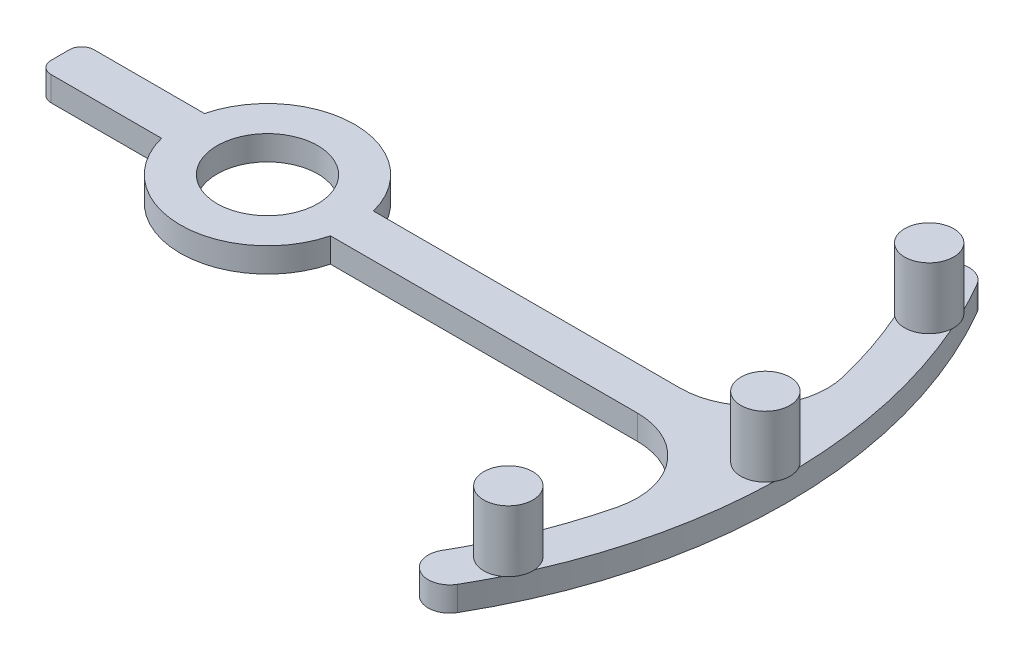
ISO-10303-21;
HEADER;
FILE_DESCRIPTION(('STEP AP214'),'2;1');
FILE_NAME('part.step','',(''),(''),'','','');
FILE_SCHEMA(('AUTOMOTIVE_DESIGN { 1 0 10303 214 1 1 1 1 }'));
ENDSEC;
DATA;
#1=APPLICATION_CONTEXT('core data for automotive mechanical design processes');
#2=APPLICATION_PROTOCOL_DEFINITION('international standard','automotive_design',2000,#1);
#3=PRODUCT_CONTEXT('',#1,'mechanical');
#4=PRODUCT('Part','Part','',(#3));
#5=PRODUCT_RELATED_PRODUCT_CATEGORY('part','',(#4));
#6=PRODUCT_DEFINITION_FORMATION('','',#4);
#7=PRODUCT_DEFINITION_CONTEXT('part definition',#1,'design');
#8=PRODUCT_DEFINITION('design','',#6,#7);
#9=PRODUCT_DEFINITION_SHAPE('','',#8);
#10=(LENGTH_UNIT() NAMED_UNIT(*) SI_UNIT(.MILLI.,.METRE.));
#11=(NAMED_UNIT(*) PLANE_ANGLE_UNIT() SI_UNIT($,.RADIAN.));
#12=(NAMED_UNIT(*) SI_UNIT($,.STERADIAN.) SOLID_ANGLE_UNIT());
#13=UNCERTAINTY_MEASURE_WITH_UNIT(LENGTH_MEASURE(1.E-05),#10,'distance_accuracy_value','');
#14=(GEOMETRIC_REPRESENTATION_CONTEXT(3) GLOBAL_UNCERTAINTY_ASSIGNED_CONTEXT((#13)) GLOBAL_UNIT_ASSIGNED_CONTEXT((#10,
#11,#12)) REPRESENTATION_CONTEXT('',''));
#15=CARTESIAN_POINT('',(0.,0.,0.));
#16=DIRECTION('',(0.,0.,1.));
#17=DIRECTION('',(1.,0.,0.));
#18=AXIS2_PLACEMENT_3D('',#15,#16,#17);
#19=CARTESIAN_POINT('',(0.,2.,0.));
#20=DIRECTION('',(0.,1.,0.));
#21=DIRECTION('',(0.,0.,1.));
#22=AXIS2_PLACEMENT_3D('',#19,#20,#21);
#23=PLANE('',#22);
#24=CARTESIAN_POINT('',(0.,2.,0.));
#25=DIRECTION('',(0.,1.,0.));
#26=DIRECTION('',(0.,0.,1.));
#27=AXIS2_PLACEMENT_3D('',#24,#25,#26);
#28=CIRCLE('',#27,4.1);
#29=CARTESIAN_POINT('',(0.,2.,4.1));
#30=VERTEX_POINT('',#29);
#31=EDGE_CURVE('E219',#30,#30,#28,.T.);
#32=ORIENTED_EDGE('',*,*,#31,.F.);
#33=EDGE_LOOP('',(#32));
#34=FACE_BOUND('',#33,.T.);
#35=CARTESIAN_POINT('',(0.,2.,0.));
#36=DIRECTION('',(0.,1.,0.));
#37=DIRECTION('',(0.,0.,1.));
#38=AXIS2_PLACEMENT_3D('',#35,#36,#37);
#39=CIRCLE('',#38,42.3094244591551);
#40=CARTESIAN_POINT('',(38.7527909101627,2.,16.9796523738904));
#41=VERTEX_POINT('',#40);
#42=CARTESIAN_POINT('',(42.2978673424984,2.,0.988845964421582));
#43=VERTEX_POINT('',#42);
#44=EDGE_CURVE('E191',#41,#43,#39,.T.);
#45=ORIENTED_EDGE('',*,*,#44,.T.);
#46=CARTESIAN_POINT('',(40.5594244591551,2.,0.));
#47=DIRECTION('',(0.,1.,0.));
#48=DIRECTION('',(0.,0.,1.));
#49=AXIS2_PLACEMENT_3D('',#46,#47,#48);
#50=CIRCLE('',#49,2.);
#51=CARTESIAN_POINT('',(42.2978673424984,2.,-0.988845964421582));
#52=VERTEX_POINT('',#51);
#53=EDGE_CURVE('E189',#52,#43,#50,.T.);
#54=ORIENTED_EDGE('',*,*,#53,.F.);
#55=CARTESIAN_POINT('',(38.7527909101627,2.,-16.9796523738904));
#56=VERTEX_POINT('',#55);
#57=EDGE_CURVE('E178',#52,#56,#39,.T.);
#58=ORIENTED_EDGE('',*,*,#57,.T.);
#59=CARTESIAN_POINT('',(36.759322225057,2.,-17.1411534621314));
#60=DIRECTION('',(0.,1.,0.));
#61=DIRECTION('',(0.,0.,1.));
#62=AXIS2_PLACEMENT_3D('',#59,#60,#61);
#63=CIRCLE('',#62,2.);
#64=CARTESIAN_POINT('',(35.5630527786396,2.,-15.5383623305212));
#65=VERTEX_POINT('',#64);
#66=EDGE_CURVE('E42',#65,#56,#63,.T.);
#67=ORIENTED_EDGE('',*,*,#66,.F.);
#68=CARTESIAN_POINT('',(0.,2.,0.));
#69=DIRECTION('',(0.,-1.,0.));
#70=DIRECTION('',(0.,0.,1.));
#71=AXIS2_PLACEMENT_3D('',#68,#69,#70);
#72=CIRCLE('',#71,38.8094244591551);
#73=CARTESIAN_POINT('',(37.7111726544024,2.,-9.16727243408407));
#74=VERTEX_POINT('',#73);
#75=EDGE_CURVE('E243',#65,#74,#72,.T.);
#76=ORIENTED_EDGE('',*,*,#75,.T.);
#77=CARTESIAN_POINT('',(31.8809641656228,2.,-7.74999723943662));
#78=DIRECTION('',(0.,-1.,0.));
#79=DIRECTION('',(0.,0.,-1.));
#80=AXIS2_PLACEMENT_3D('',#77,#78,#79);
#81=CIRCLE('',#80,6.);
#82=CARTESIAN_POINT('',(31.8809641656226,2.,-1.74999723943662));
#83=VERTEX_POINT('',#82);
#84=EDGE_CURVE('E247',#74,#83,#81,.T.);
#85=ORIENTED_EDGE('',*,*,#84,.T.);
#86=DIRECTION('',(-1.,0.,0.));
#87=VECTOR('',#86,1.);
#88=CARTESIAN_POINT('',(6.88096422764181,2.,-1.74999723943758));
#89=LINE('',#88,#87);
#90=CARTESIAN_POINT('',(6.88096422764181,2.,-1.74999723943758));
#91=VERTEX_POINT('',#90);
#92=EDGE_CURVE('E250',#83,#91,#89,.T.);
#93=ORIENTED_EDGE('',*,*,#92,.T.);
#94=CARTESIAN_POINT('',(0.,2.,0.));
#95=DIRECTION('',(0.,1.,0.));
#96=DIRECTION('',(0.,0.,1.));
#97=AXIS2_PLACEMENT_3D('',#94,#95,#96);
#98=CIRCLE('',#97,7.1000112);
#99=CARTESIAN_POINT('',(-6.88132233720513,2.,-1.74858855412219));
#100=VERTEX_POINT('',#99);
#101=EDGE_CURVE('E252',#91,#100,#98,.T.);
#102=ORIENTED_EDGE('',*,*,#101,.T.);
#103=DIRECTION('',(-1.,0.,0.));
#104=VECTOR('',#103,1.);
#105=CARTESIAN_POINT('',(-6.88132233720513,2.,-1.74858855412218));
#106=LINE('',#105,#104);
#107=CARTESIAN_POINT('',(-15.8813223372051,2.,-1.74858855412218));
#108=VERTEX_POINT('',#107);
#109=EDGE_CURVE('E254',#100,#108,#106,.T.);
#110=ORIENTED_EDGE('',*,*,#109,.T.);
#111=CARTESIAN_POINT('',(-15.8813223372051,2.,-0.748588554122185));
#112=DIRECTION('',(0.,1.,0.));
#113=DIRECTION('',(0.,0.,1.));
#114=AXIS2_PLACEMENT_3D('',#111,#112,#113);
#115=CIRCLE('',#114,1.);
#116=CARTESIAN_POINT('',(-16.8813223372051,2.,-0.748588554122185));
#117=VERTEX_POINT('',#116);
#118=EDGE_CURVE('E256',#108,#117,#115,.T.);
#119=ORIENTED_EDGE('',*,*,#118,.T.);
#120=DIRECTION('',(0.,0.,1.));
#121=VECTOR('',#120,1.);
#122=CARTESIAN_POINT('',(-16.8813223372051,2.,-0.748588554122185));
#123=LINE('',#122,#121);
#124=CARTESIAN_POINT('',(-16.8813223372051,2.,0.748588554122185));
#125=VERTEX_POINT('',#124);
#126=EDGE_CURVE('E258',#117,#125,#123,.T.);
#127=ORIENTED_EDGE('',*,*,#126,.T.);
#128=CARTESIAN_POINT('',(-15.8813223372051,2.,0.748588554122185));
#129=DIRECTION('',(0.,1.,0.));
#130=DIRECTION('',(0.,0.,-1.));
#131=AXIS2_PLACEMENT_3D('',#128,#129,#130);
#132=CIRCLE('',#131,1.);
#133=CARTESIAN_POINT('',(-15.8813223372051,2.,1.74858855412219));
#134=VERTEX_POINT('',#133);
#135=EDGE_CURVE('E260',#125,#134,#132,.T.);
#136=ORIENTED_EDGE('',*,*,#135,.T.);
#137=DIRECTION('',(1.,0.,0.));
#138=VECTOR('',#137,1.);
#139=CARTESIAN_POINT('',(-6.88132233720513,2.,1.74858855412218));
#140=LINE('',#139,#138);
#141=CARTESIAN_POINT('',(-6.88132233720513,2.,1.74858855412218));
#142=VERTEX_POINT('',#141);
#143=EDGE_CURVE('E262',#134,#142,#140,.T.);
#144=ORIENTED_EDGE('',*,*,#143,.T.);
#145=CARTESIAN_POINT('',(0.,2.,0.));
#146=DIRECTION('',(0.,1.,0.));
#147=DIRECTION('',(0.,0.,1.));
#148=AXIS2_PLACEMENT_3D('',#145,#146,#147);
#149=CIRCLE('',#148,7.1000112);
#150=CARTESIAN_POINT('',(6.88096282348233,2.,1.75000276056338));
#151=VERTEX_POINT('',#150);
#152=EDGE_CURVE('E225',#142,#151,#149,.T.);
#153=ORIENTED_EDGE('',*,*,#152,.T.);
#154=DIRECTION('',(1.,0.,0.));
#155=VECTOR('',#154,1.);
#156=CARTESIAN_POINT('',(6.88096282348233,2.,1.75000276056338));
#157=LINE('',#156,#155);
#158=CARTESIAN_POINT('',(31.8809628234826,2.,1.75000276056338));
#159=VERTEX_POINT('',#158);
#160=EDGE_CURVE('E228',#151,#159,#157,.T.);
#161=ORIENTED_EDGE('',*,*,#160,.T.);
#162=CARTESIAN_POINT('',(31.8809628234823,2.,7.75000276056338));
#163=DIRECTION('',(0.,-1.,0.));
#164=DIRECTION('',(0.,0.,1.));
#165=AXIS2_PLACEMENT_3D('',#162,#163,#164);
#166=CIRCLE('',#165,6.);
#167=CARTESIAN_POINT('',(37.7111710668189,2.,9.16727896488293));
#168=VERTEX_POINT('',#167);
#169=EDGE_CURVE('E231',#159,#168,#166,.T.);
#170=ORIENTED_EDGE('',*,*,#169,.T.);
#171=CARTESIAN_POINT('',(0.,2.,0.));
#172=DIRECTION('',(0.,-1.,0.));
#173=DIRECTION('',(0.,0.,1.));
#174=AXIS2_PLACEMENT_3D('',#171,#172,#173);
#175=CIRCLE('',#174,38.8094244591551);
#176=CARTESIAN_POINT('',(35.5630527786396,2.,15.5383623305212));
#177=VERTEX_POINT('',#176);
#178=EDGE_CURVE('E234',#168,#177,#175,.T.);
#179=ORIENTED_EDGE('',*,*,#178,.T.);
#180=CARTESIAN_POINT('',(36.759322225057,2.,17.1411534621314));
#181=DIRECTION('',(0.,1.,0.));
#182=DIRECTION('',(0.,0.,-1.));
#183=AXIS2_PLACEMENT_3D('',#180,#181,#182);
#184=CIRCLE('',#183,2.);
#185=EDGE_CURVE('E202',#41,#177,#184,.T.);
#186=ORIENTED_EDGE('',*,*,#185,.F.);
#187=EDGE_LOOP('',(#45,#54,#58,#67,#76,#85,#93,#102,#110,#119,#127,#136,#144,#153,#161,#170,
#179,#186));
#188=FACE_BOUND('',#187,.T.);
#189=ADVANCED_FACE('F33',(#34,#188),#23,.T.);
#190=CARTESIAN_POINT('',(37.9169821849363,2.,-18.7720499693605));
#191=VERTEX_POINT('',#190);
#192=CARTESIAN_POINT('',(34.7625658072029,2.,-17.2550121805448));
#193=VERTEX_POINT('',#192);
#194=EDGE_CURVE('E11',#191,#193,#63,.T.);
#195=ORIENTED_EDGE('',*,*,#194,.F.);
#196=CARTESIAN_POINT('',(36.6410364011269,2.,-21.1547122295776));
#197=VERTEX_POINT('',#196);
#198=EDGE_CURVE('E238',#191,#197,#39,.T.);
#199=ORIENTED_EDGE('',*,*,#198,.T.);
#200=CARTESIAN_POINT('',(35.1254919445042,2.,-20.2797122295776));
#201=DIRECTION('',(0.,1.,0.));
#202=DIRECTION('',(0.,0.,-1.));
#203=AXIS2_PLACEMENT_3D('',#200,#201,#202);
#204=CIRCLE('',#203,1.74999999999999);
#205=CARTESIAN_POINT('',(33.6099474878814,2.,-19.4047122295776));
#206=VERTEX_POINT('',#205);
#207=EDGE_CURVE('E240',#197,#206,#204,.T.);
#208=ORIENTED_EDGE('',*,*,#207,.T.);
#209=EDGE_CURVE('E244',#206,#193,#72,.T.);
#210=ORIENTED_EDGE('',*,*,#209,.T.);
#211=EDGE_LOOP('',(#195,#199,#208,#210));
#212=FACE_BOUND('',#211,.T.);
#213=ADVANCED_FACE('F389',(#212),#23,.T.);
#214=CARTESIAN_POINT('',(36.6410364011269,2.,21.1547122295776));
#215=VERTEX_POINT('',#214);
#216=CARTESIAN_POINT('',(37.9169821849364,2.,18.7720499693605));
#217=VERTEX_POINT('',#216);
#218=EDGE_CURVE('E187',#215,#217,#39,.T.);
#219=ORIENTED_EDGE('',*,*,#218,.T.);
#220=CARTESIAN_POINT('',(34.7625658072029,2.,17.2550121805448));
#221=VERTEX_POINT('',#220);
#222=EDGE_CURVE('E59',#221,#217,#184,.T.);
#223=ORIENTED_EDGE('',*,*,#222,.F.);
#224=CARTESIAN_POINT('',(33.6099474878814,2.,19.4047122295776));
#225=VERTEX_POINT('',#224);
#226=EDGE_CURVE('E233',#221,#225,#175,.T.);
#227=ORIENTED_EDGE('',*,*,#226,.T.);
#228=CARTESIAN_POINT('',(35.1254919445042,2.,20.2797122295776));
#229=DIRECTION('',(0.,1.,0.));
#230=DIRECTION('',(0.,0.,1.));
#231=AXIS2_PLACEMENT_3D('',#228,#229,#230);
#232=CIRCLE('',#231,1.74999999999999);
#233=EDGE_CURVE('E237',#225,#215,#232,.T.);
#234=ORIENTED_EDGE('',*,*,#233,.T.);
#235=EDGE_LOOP('',(#219,#223,#227,#234));
#236=FACE_BOUND('',#235,.T.);
#237=ADVANCED_FACE('F387',(#236),#23,.T.);
#238=CARTESIAN_POINT('',(0.,0.,0.));
#239=DIRECTION('',(0.,1.,0.));
#240=DIRECTION('',(0.,0.,1.));
#241=AXIS2_PLACEMENT_3D('',#238,#239,#240);
#242=PLANE('',#241);
#243=CARTESIAN_POINT('',(0.,0.,0.));
#244=DIRECTION('',(0.,1.,0.));
#245=DIRECTION('',(0.,0.,1.));
#246=AXIS2_PLACEMENT_3D('',#243,#244,#245);
#247=CIRCLE('',#246,7.1000112);
#248=CARTESIAN_POINT('',(-6.88132233720513,0.,1.74858855412218));
#249=VERTEX_POINT('',#248);
#250=CARTESIAN_POINT('',(6.88096282348233,0.,1.75000276056338));
#251=VERTEX_POINT('',#250);
#252=EDGE_CURVE('E222',#249,#251,#247,.T.);
#253=ORIENTED_EDGE('',*,*,#252,.F.);
#254=DIRECTION('',(1.,0.,0.));
#255=VECTOR('',#254,1.);
#256=CARTESIAN_POINT('',(-6.88132233720513,0.,1.74858855412218));
#257=LINE('',#256,#255);
#258=CARTESIAN_POINT('',(-15.8813223372051,0.,1.74858855412219));
#259=VERTEX_POINT('',#258);
#260=EDGE_CURVE('E229',#259,#249,#257,.T.);
#261=ORIENTED_EDGE('',*,*,#260,.F.);
#262=CARTESIAN_POINT('',(-15.8813223372051,0.,0.748588554122185));
#263=DIRECTION('',(0.,1.,0.));
#264=DIRECTION('',(0.,0.,-1.));
#265=AXIS2_PLACEMENT_3D('',#262,#263,#264);
#266=CIRCLE('',#265,1.);
#267=CARTESIAN_POINT('',(-16.8813223372051,0.,0.748588554122185));
#268=VERTEX_POINT('',#267);
#269=EDGE_CURVE('E293',#268,#259,#266,.T.);
#270=ORIENTED_EDGE('',*,*,#269,.F.);
#271=DIRECTION('',(0.,0.,1.));
#272=VECTOR('',#271,1.);
#273=CARTESIAN_POINT('',(-16.8813223372051,0.,-0.748588554122185));
#274=LINE('',#273,#272);
#275=CARTESIAN_POINT('',(-16.8813223372051,0.,-0.748588554122185));
#276=VERTEX_POINT('',#275);
#277=EDGE_CURVE('E291',#276,#268,#274,.T.);
#278=ORIENTED_EDGE('',*,*,#277,.F.);
#279=CARTESIAN_POINT('',(-15.8813223372051,0.,-0.748588554122185));
#280=DIRECTION('',(0.,1.,0.));
#281=DIRECTION('',(0.,0.,1.));
#282=AXIS2_PLACEMENT_3D('',#279,#280,#281);
#283=CIRCLE('',#282,1.);
#284=CARTESIAN_POINT('',(-15.8813223372051,0.,-1.74858855412218));
#285=VERTEX_POINT('',#284);
#286=EDGE_CURVE('E289',#285,#276,#283,.T.);
#287=ORIENTED_EDGE('',*,*,#286,.F.);
#288=DIRECTION('',(-1.,0.,0.));
#289=VECTOR('',#288,1.);
#290=CARTESIAN_POINT('',(-6.88132233720513,0.,-1.74858855412218));
#291=LINE('',#290,#289);
#292=CARTESIAN_POINT('',(-6.88132233720513,0.,-1.74858855412219));
#293=VERTEX_POINT('',#292);
#294=EDGE_CURVE('E287',#293,#285,#291,.T.);
#295=ORIENTED_EDGE('',*,*,#294,.F.);
#296=CARTESIAN_POINT('',(0.,0.,0.));
#297=DIRECTION('',(0.,1.,0.));
#298=DIRECTION('',(0.,0.,1.));
#299=AXIS2_PLACEMENT_3D('',#296,#297,#298);
#300=CIRCLE('',#299,7.1000112);
#301=CARTESIAN_POINT('',(6.88096422764181,0.,-1.74999723943758));
#302=VERTEX_POINT('',#301);
#303=EDGE_CURVE('E285',#302,#293,#300,.T.);
#304=ORIENTED_EDGE('',*,*,#303,.F.);
#305=DIRECTION('',(-1.,0.,0.));
#306=VECTOR('',#305,1.);
#307=CARTESIAN_POINT('',(6.88096422764181,0.,-1.74999723943758));
#308=LINE('',#307,#306);
#309=CARTESIAN_POINT('',(31.8809641656226,0.,-1.74999723943662));
#310=VERTEX_POINT('',#309);
#311=EDGE_CURVE('E283',#310,#302,#308,.T.);
#312=ORIENTED_EDGE('',*,*,#311,.F.);
#313=CARTESIAN_POINT('',(31.8809641656228,0.,-7.74999723943662));
#314=DIRECTION('',(0.,-1.,0.));
#315=DIRECTION('',(0.,0.,-1.));
#316=AXIS2_PLACEMENT_3D('',#313,#314,#315);
#317=CIRCLE('',#316,6.);
#318=CARTESIAN_POINT('',(37.7111726544024,0.,-9.16727243408407));
#319=VERTEX_POINT('',#318);
#320=EDGE_CURVE('E281',#319,#310,#317,.T.);
#321=ORIENTED_EDGE('',*,*,#320,.F.);
#322=CARTESIAN_POINT('',(0.,0.,0.));
#323=DIRECTION('',(0.,-1.,0.));
#324=DIRECTION('',(0.,0.,1.));
#325=AXIS2_PLACEMENT_3D('',#322,#323,#324);
#326=CIRCLE('',#325,38.8094244591551);
#327=CARTESIAN_POINT('',(33.6099474878814,0.,-19.4047122295776));
#328=VERTEX_POINT('',#327);
#329=EDGE_CURVE('E279',#328,#319,#326,.T.);
#330=ORIENTED_EDGE('',*,*,#329,.F.);
#331=CARTESIAN_POINT('',(35.1254919445042,0.,-20.2797122295776));
#332=DIRECTION('',(0.,1.,0.));
#333=DIRECTION('',(0.,0.,-1.));
#334=AXIS2_PLACEMENT_3D('',#331,#332,#333);
#335=CIRCLE('',#334,1.74999999999999);
#336=CARTESIAN_POINT('',(36.6410364011269,0.,-21.1547122295776));
#337=VERTEX_POINT('',#336);
#338=EDGE_CURVE('E277',#337,#328,#335,.T.);
#339=ORIENTED_EDGE('',*,*,#338,.F.);
#340=CARTESIAN_POINT('',(0.,0.,0.));
#341=DIRECTION('',(0.,1.,0.));
#342=DIRECTION('',(0.,0.,1.));
#343=AXIS2_PLACEMENT_3D('',#340,#341,#342);
#344=CIRCLE('',#343,42.3094244591551);
#345=CARTESIAN_POINT('',(36.6410364011269,0.,21.1547122295776));
#346=VERTEX_POINT('',#345);
#347=EDGE_CURVE('E275',#346,#337,#344,.T.);
#348=ORIENTED_EDGE('',*,*,#347,.F.);
#349=CARTESIAN_POINT('',(35.1254919445042,0.,20.2797122295776));
#350=DIRECTION('',(0.,1.,0.));
#351=DIRECTION('',(0.,0.,1.));
#352=AXIS2_PLACEMENT_3D('',#349,#350,#351);
#353=CIRCLE('',#352,1.74999999999999);
#354=CARTESIAN_POINT('',(33.6099474878814,0.,19.4047122295776));
#355=VERTEX_POINT('',#354);
#356=EDGE_CURVE('E273',#355,#346,#353,.T.);
#357=ORIENTED_EDGE('',*,*,#356,.F.);
#358=CARTESIAN_POINT('',(0.,0.,0.));
#359=DIRECTION('',(0.,-1.,0.));
#360=DIRECTION('',(0.,0.,1.));
#361=AXIS2_PLACEMENT_3D('',#358,#359,#360);
#362=CIRCLE('',#361,38.8094244591551);
#363=CARTESIAN_POINT('',(37.7111710668189,0.,9.16727896488293));
#364=VERTEX_POINT('',#363);
#365=EDGE_CURVE('E271',#364,#355,#362,.T.);
#366=ORIENTED_EDGE('',*,*,#365,.F.);
#367=CARTESIAN_POINT('',(31.8809628234823,0.,7.75000276056338));
#368=DIRECTION('',(0.,-1.,0.));
#369=DIRECTION('',(0.,0.,1.));
#370=AXIS2_PLACEMENT_3D('',#367,#368,#369);
#371=CIRCLE('',#370,6.);
#372=CARTESIAN_POINT('',(31.8809628234826,0.,1.75000276056338));
#373=VERTEX_POINT('',#372);
#374=EDGE_CURVE('E269',#373,#364,#371,.T.);
#375=ORIENTED_EDGE('',*,*,#374,.F.);
#376=DIRECTION('',(1.,0.,0.));
#377=VECTOR('',#376,1.);
#378=CARTESIAN_POINT('',(6.88096282348233,0.,1.75000276056338));
#379=LINE('',#378,#377);
#380=EDGE_CURVE('E267',#251,#373,#379,.T.);
#381=ORIENTED_EDGE('',*,*,#380,.F.);
#382=EDGE_LOOP('',(#253,#261,#270,#278,#287,#295,#304,#312,#321,#330,#339,#348,#357,#366,#375,#381));
#383=FACE_BOUND('',#382,.T.);
#384=CARTESIAN_POINT('',(0.,0.,0.));
#385=DIRECTION('',(0.,1.,0.));
#386=DIRECTION('',(0.,0.,1.));
#387=AXIS2_PLACEMENT_3D('',#384,#385,#386);
#388=CIRCLE('',#387,4.1);
#389=CARTESIAN_POINT('',(0.,0.,4.1));
#390=VERTEX_POINT('',#389);
#391=EDGE_CURVE('E215',#390,#390,#388,.T.);
#392=ORIENTED_EDGE('',*,*,#391,.T.);
#393=EDGE_LOOP('',(#392));
#394=FACE_BOUND('',#393,.T.);
#395=ADVANCED_FACE('F379',(#383,#394),#242,.F.);
#396=CARTESIAN_POINT('',(0.,2.,0.));
#397=DIRECTION('',(0.,-1.,0.));
#398=DIRECTION('',(0.,0.,-1.));
#399=AXIS2_PLACEMENT_3D('',#396,#397,#398);
#400=CYLINDRICAL_SURFACE('',#399,7.1000112);
#401=ORIENTED_EDGE('',*,*,#252,.T.);
#402=DIRECTION('',(0.,-1.,0.));
#403=VECTOR('',#402,1.);
#404=CARTESIAN_POINT('',(6.88096282348233,2.,1.75000276056338));
#405=LINE('',#404,#403);
#406=EDGE_CURVE('E37',#151,#251,#405,.T.);
#407=ORIENTED_EDGE('',*,*,#406,.F.);
#408=ORIENTED_EDGE('',*,*,#152,.F.);
#409=DIRECTION('',(0.,-1.,0.));
#410=VECTOR('',#409,1.);
#411=CARTESIAN_POINT('',(-6.88132233720513,2.,1.74858855412218));
#412=LINE('',#411,#410);
#413=EDGE_CURVE('E264',#142,#249,#412,.T.);
#414=ORIENTED_EDGE('',*,*,#413,.T.);
#415=EDGE_LOOP('',(#401,#407,#408,#414));
#416=FACE_BOUND('',#415,.T.);
#417=ADVANCED_FACE('F35',(#416),#400,.T.);
#418=CARTESIAN_POINT('',(6.88096282348233,2.,1.75000276056338));
#419=DIRECTION('',(0.,0.,-1.));
#420=DIRECTION('',(-1.,0.,0.));
#421=AXIS2_PLACEMENT_3D('',#418,#419,#420);
#422=PLANE('',#421);
#423=ORIENTED_EDGE('',*,*,#380,.T.);
#424=DIRECTION('',(0.,-1.,0.));
#425=VECTOR('',#424,1.);
#426=CARTESIAN_POINT('',(31.8809628234826,2.,1.75000276056338));
#427=LINE('',#426,#425);
#428=EDGE_CURVE('E336',#159,#373,#427,.T.);
#429=ORIENTED_EDGE('',*,*,#428,.F.);
#430=ORIENTED_EDGE('',*,*,#160,.F.);
#431=ORIENTED_EDGE('',*,*,#406,.T.);
#432=EDGE_LOOP('',(#423,#429,#430,#431));
#433=FACE_BOUND('',#432,.T.);
#434=ADVANCED_FACE('F629',(#433),#422,.F.);
#435=CARTESIAN_POINT('',(31.8809628234823,2.,7.75000276056338));
#436=DIRECTION('',(0.,-1.,0.));
#437=DIRECTION('',(0.,0.,-1.));
#438=AXIS2_PLACEMENT_3D('',#435,#436,#437);
#439=CYLINDRICAL_SURFACE('',#438,6.);
#440=ORIENTED_EDGE('',*,*,#374,.T.);
#441=DIRECTION('',(0.,-1.,0.));
#442=VECTOR('',#441,1.);
#443=CARTESIAN_POINT('',(37.7111710668189,2.,9.16727896488293));
#444=LINE('',#443,#442);
#445=EDGE_CURVE('E334',#168,#364,#444,.T.);
#446=ORIENTED_EDGE('',*,*,#445,.F.);
#447=ORIENTED_EDGE('',*,*,#169,.F.);
#448=ORIENTED_EDGE('',*,*,#428,.T.);
#449=EDGE_LOOP('',(#440,#446,#447,#448));
#450=FACE_BOUND('',#449,.T.);
#451=ADVANCED_FACE('F374',(#450),#439,.F.);
#452=CARTESIAN_POINT('',(0.,2.,0.));
#453=DIRECTION('',(0.,-1.,0.));
#454=DIRECTION('',(0.,0.,-1.));
#455=AXIS2_PLACEMENT_3D('',#452,#453,#454);
#456=CYLINDRICAL_SURFACE('',#455,38.8094244591551);
#457=ORIENTED_EDGE('',*,*,#365,.T.);
#458=DIRECTION('',(0.,-1.,0.));
#459=VECTOR('',#458,1.);
#460=CARTESIAN_POINT('',(33.6099474878814,2.,19.4047122295776));
#461=LINE('',#460,#459);
#462=EDGE_CURVE('E331',#225,#355,#461,.T.);
#463=ORIENTED_EDGE('',*,*,#462,.F.);
#464=ORIENTED_EDGE('',*,*,#226,.F.);
#465=CARTESIAN_POINT('',(0.,2.,0.));
#466=DIRECTION('',(0.,-1.,0.));
#467=DIRECTION('',(0.,0.,-1.));
#468=AXIS2_PLACEMENT_3D('',#465,#466,#467);
#469=CIRCLE('',#468,38.8094244591551);
#470=EDGE_CURVE('E208',#221,#177,#469,.F.);
#471=ORIENTED_EDGE('',*,*,#470,.T.);
#472=ORIENTED_EDGE('',*,*,#178,.F.);
#473=ORIENTED_EDGE('',*,*,#445,.T.);
#474=EDGE_LOOP('',(#457,#463,#464,#471,#472,#473));
#475=FACE_BOUND('',#474,.T.);
#476=ADVANCED_FACE('F371',(#475),#456,.F.);
#477=CARTESIAN_POINT('',(35.1254919445042,2.,20.2797122295776));
#478=DIRECTION('',(0.,-1.,0.));
#479=DIRECTION('',(0.,0.,-1.));
#480=AXIS2_PLACEMENT_3D('',#477,#478,#479);
#481=CYLINDRICAL_SURFACE('',#480,1.74999999999999);
#482=ORIENTED_EDGE('',*,*,#356,.T.);
#483=DIRECTION('',(0.,-1.,0.));
#484=VECTOR('',#483,1.);
#485=CARTESIAN_POINT('',(36.6410364011269,2.,21.1547122295776));
#486=LINE('',#485,#484);
#487=EDGE_CURVE('E328',#215,#346,#486,.T.);
#488=ORIENTED_EDGE('',*,*,#487,.F.);
#489=ORIENTED_EDGE('',*,*,#233,.F.);
#490=ORIENTED_EDGE('',*,*,#462,.T.);
#491=EDGE_LOOP('',(#482,#488,#489,#490));
#492=FACE_BOUND('',#491,.T.);
#493=ADVANCED_FACE('F385',(#492),#481,.T.);
#494=CARTESIAN_POINT('',(0.,2.,0.));
#495=DIRECTION('',(0.,-1.,0.));
#496=DIRECTION('',(0.,0.,-1.));
#497=AXIS2_PLACEMENT_3D('',#494,#495,#496);
#498=CYLINDRICAL_SURFACE('',#497,42.3094244591551);
#499=ORIENTED_EDGE('',*,*,#347,.T.);
#500=DIRECTION('',(0.,-1.,0.));
#501=VECTOR('',#500,1.);
#502=CARTESIAN_POINT('',(36.6410364011269,2.,-21.1547122295776));
#503=LINE('',#502,#501);
#504=EDGE_CURVE('E325',#197,#337,#503,.T.);
#505=ORIENTED_EDGE('',*,*,#504,.F.);
#506=ORIENTED_EDGE('',*,*,#198,.F.);
#507=EDGE_CURVE('E183',#56,#191,#39,.T.);
#508=ORIENTED_EDGE('',*,*,#507,.F.);
#509=ORIENTED_EDGE('',*,*,#57,.F.);
#510=EDGE_CURVE('E51',#43,#52,#39,.T.);
#511=ORIENTED_EDGE('',*,*,#510,.F.);
#512=ORIENTED_EDGE('',*,*,#44,.F.);
#513=EDGE_CURVE('E241',#217,#41,#39,.T.);
#514=ORIENTED_EDGE('',*,*,#513,.F.);
#515=ORIENTED_EDGE('',*,*,#218,.F.);
#516=ORIENTED_EDGE('',*,*,#487,.T.);
#517=EDGE_LOOP('',(#499,#505,#506,#508,#509,#511,#512,#514,#515,#516));
#518=FACE_BOUND('',#517,.T.);
#519=ADVANCED_FACE('F180',(#518),#498,.T.);
#520=CARTESIAN_POINT('',(35.1254919445042,2.,-20.2797122295776));
#521=DIRECTION('',(0.,-1.,0.));
#522=DIRECTION('',(0.,0.,-1.));
#523=AXIS2_PLACEMENT_3D('',#520,#521,#522);
#524=CYLINDRICAL_SURFACE('',#523,1.74999999999999);
#525=ORIENTED_EDGE('',*,*,#338,.T.);
#526=DIRECTION('',(0.,-1.,0.));
#527=VECTOR('',#526,1.);
#528=CARTESIAN_POINT('',(33.6099474878814,2.,-19.4047122295776));
#529=LINE('',#528,#527);
#530=EDGE_CURVE('E322',#206,#328,#529,.T.);
#531=ORIENTED_EDGE('',*,*,#530,.F.);
#532=ORIENTED_EDGE('',*,*,#207,.F.);
#533=ORIENTED_EDGE('',*,*,#504,.T.);
#534=EDGE_LOOP('',(#525,#531,#532,#533));
#535=FACE_BOUND('',#534,.T.);
#536=ADVANCED_FACE('F592',(#535),#524,.T.);
#537=CARTESIAN_POINT('',(0.,2.,0.));
#538=DIRECTION('',(0.,-1.,0.));
#539=DIRECTION('',(0.,0.,-1.));
#540=AXIS2_PLACEMENT_3D('',#537,#538,#539);
#541=CYLINDRICAL_SURFACE('',#540,38.8094244591551);
#542=ORIENTED_EDGE('',*,*,#329,.T.);
#543=DIRECTION('',(0.,-1.,0.));
#544=VECTOR('',#543,1.);
#545=CARTESIAN_POINT('',(37.7111726544024,2.,-9.16727243408407));
#546=LINE('',#545,#544);
#547=EDGE_CURVE('E319',#74,#319,#546,.T.);
#548=ORIENTED_EDGE('',*,*,#547,.F.);
#549=ORIENTED_EDGE('',*,*,#75,.F.);
#550=EDGE_CURVE('E248',#193,#65,#72,.T.);
#551=ORIENTED_EDGE('',*,*,#550,.F.);
#552=ORIENTED_EDGE('',*,*,#209,.F.);
#553=ORIENTED_EDGE('',*,*,#530,.T.);
#554=EDGE_LOOP('',(#542,#548,#549,#551,#552,#553));
#555=FACE_BOUND('',#554,.T.);
#556=ADVANCED_FACE('F583',(#555),#541,.F.);
#557=CARTESIAN_POINT('',(31.8809641656228,2.,-7.74999723943662));
#558=DIRECTION('',(0.,-1.,0.));
#559=DIRECTION('',(0.,0.,-1.));
#560=AXIS2_PLACEMENT_3D('',#557,#558,#559);
#561=CYLINDRICAL_SURFACE('',#560,6.);
#562=ORIENTED_EDGE('',*,*,#320,.T.);
#563=DIRECTION('',(0.,-1.,0.));
#564=VECTOR('',#563,1.);
#565=CARTESIAN_POINT('',(31.8809641656226,2.,-1.74999723943662));
#566=LINE('',#565,#564);
#567=EDGE_CURVE('E316',#83,#310,#566,.T.);
#568=ORIENTED_EDGE('',*,*,#567,.F.);
#569=ORIENTED_EDGE('',*,*,#84,.F.);
#570=ORIENTED_EDGE('',*,*,#547,.T.);
#571=EDGE_LOOP('',(#562,#568,#569,#570));
#572=FACE_BOUND('',#571,.T.);
#573=ADVANCED_FACE('F574',(#572),#561,.F.);
#574=CARTESIAN_POINT('',(6.88096422764181,2.,-1.74999723943758));
#575=DIRECTION('',(0.,0.,1.));
#576=DIRECTION('',(1.,0.,0.));
#577=AXIS2_PLACEMENT_3D('',#574,#575,#576);
#578=PLANE('',#577);
#579=ORIENTED_EDGE('',*,*,#311,.T.);
#580=DIRECTION('',(0.,-1.,0.));
#581=VECTOR('',#580,1.);
#582=CARTESIAN_POINT('',(6.88096422764181,2.,-1.74999723943758));
#583=LINE('',#582,#581);
#584=EDGE_CURVE('E313',#91,#302,#583,.T.);
#585=ORIENTED_EDGE('',*,*,#584,.F.);
#586=ORIENTED_EDGE('',*,*,#92,.F.);
#587=ORIENTED_EDGE('',*,*,#567,.T.);
#588=EDGE_LOOP('',(#579,#585,#586,#587));
#589=FACE_BOUND('',#588,.T.);
#590=ADVANCED_FACE('F565',(#589),#578,.F.);
#591=CARTESIAN_POINT('',(0.,2.,0.));
#592=DIRECTION('',(0.,-1.,0.));
#593=DIRECTION('',(0.,0.,-1.));
#594=AXIS2_PLACEMENT_3D('',#591,#592,#593);
#595=CYLINDRICAL_SURFACE('',#594,7.1000112);
#596=ORIENTED_EDGE('',*,*,#303,.T.);
#597=DIRECTION('',(0.,-1.,0.));
#598=VECTOR('',#597,1.);
#599=CARTESIAN_POINT('',(-6.88132233720513,2.,-1.74858855412219));
#600=LINE('',#599,#598);
#601=EDGE_CURVE('E310',#100,#293,#600,.T.);
#602=ORIENTED_EDGE('',*,*,#601,.F.);
#603=ORIENTED_EDGE('',*,*,#101,.F.);
#604=ORIENTED_EDGE('',*,*,#584,.T.);
#605=EDGE_LOOP('',(#596,#602,#603,#604));
#606=FACE_BOUND('',#605,.T.);
#607=ADVANCED_FACE('F556',(#606),#595,.T.);
#608=CARTESIAN_POINT('',(-6.88132233720513,2.,-1.74858855412218));
#609=DIRECTION('',(0.,0.,1.));
#610=DIRECTION('',(1.,0.,0.));
#611=AXIS2_PLACEMENT_3D('',#608,#609,#610);
#612=PLANE('',#611);
#613=ORIENTED_EDGE('',*,*,#294,.T.);
#614=DIRECTION('',(0.,-1.,0.));
#615=VECTOR('',#614,1.);
#616=CARTESIAN_POINT('',(-15.8813223372051,2.,-1.74858855412218));
#617=LINE('',#616,#615);
#618=EDGE_CURVE('E307',#108,#285,#617,.T.);
#619=ORIENTED_EDGE('',*,*,#618,.F.);
#620=ORIENTED_EDGE('',*,*,#109,.F.);
#621=ORIENTED_EDGE('',*,*,#601,.T.);
#622=EDGE_LOOP('',(#613,#619,#620,#621));
#623=FACE_BOUND('',#622,.T.);
#624=ADVANCED_FACE('F547',(#623),#612,.F.);
#625=CARTESIAN_POINT('',(-15.8813223372051,2.,-0.748588554122185));
#626=DIRECTION('',(0.,-1.,0.));
#627=DIRECTION('',(0.,0.,-1.));
#628=AXIS2_PLACEMENT_3D('',#625,#626,#627);
#629=CYLINDRICAL_SURFACE('',#628,1.);
#630=ORIENTED_EDGE('',*,*,#286,.T.);
#631=DIRECTION('',(0.,-1.,0.));
#632=VECTOR('',#631,1.);
#633=CARTESIAN_POINT('',(-16.8813223372051,2.,-0.748588554122185));
#634=LINE('',#633,#632);
#635=EDGE_CURVE('E304',#117,#276,#634,.T.);
#636=ORIENTED_EDGE('',*,*,#635,.F.);
#637=ORIENTED_EDGE('',*,*,#118,.F.);
#638=ORIENTED_EDGE('',*,*,#618,.T.);
#639=EDGE_LOOP('',(#630,#636,#637,#638));
#640=FACE_BOUND('',#639,.T.);
#641=ADVANCED_FACE('F538',(#640),#629,.T.);
#642=CARTESIAN_POINT('',(-16.8813223372051,2.,-0.748588554122185));
#643=DIRECTION('',(1.,0.,0.));
#644=DIRECTION('',(0.,0.,-1.));
#645=AXIS2_PLACEMENT_3D('',#642,#643,#644);
#646=PLANE('',#645);
#647=ORIENTED_EDGE('',*,*,#277,.T.);
#648=DIRECTION('',(0.,-1.,0.));
#649=VECTOR('',#648,1.);
#650=CARTESIAN_POINT('',(-16.8813223372051,2.,0.748588554122185));
#651=LINE('',#650,#649);
#652=EDGE_CURVE('E301',#125,#268,#651,.T.);
#653=ORIENTED_EDGE('',*,*,#652,.F.);
#654=ORIENTED_EDGE('',*,*,#126,.F.);
#655=ORIENTED_EDGE('',*,*,#635,.T.);
#656=EDGE_LOOP('',(#647,#653,#654,#655));
#657=FACE_BOUND('',#656,.T.);
#658=ADVANCED_FACE('F529',(#657),#646,.F.);
#659=CARTESIAN_POINT('',(-15.8813223372051,2.,0.748588554122185));
#660=DIRECTION('',(0.,-1.,0.));
#661=DIRECTION('',(0.,0.,-1.));
#662=AXIS2_PLACEMENT_3D('',#659,#660,#661);
#663=CYLINDRICAL_SURFACE('',#662,1.);
#664=ORIENTED_EDGE('',*,*,#269,.T.);
#665=DIRECTION('',(0.,-1.,0.));
#666=VECTOR('',#665,1.);
#667=CARTESIAN_POINT('',(-15.8813223372051,2.,1.74858855412219));
#668=LINE('',#667,#666);
#669=EDGE_CURVE('E298',#134,#259,#668,.T.);
#670=ORIENTED_EDGE('',*,*,#669,.F.);
#671=ORIENTED_EDGE('',*,*,#135,.F.);
#672=ORIENTED_EDGE('',*,*,#652,.T.);
#673=EDGE_LOOP('',(#664,#670,#671,#672));
#674=FACE_BOUND('',#673,.T.);
#675=ADVANCED_FACE('F414',(#674),#663,.T.);
#676=CARTESIAN_POINT('',(-6.88132233720513,2.,1.74858855412218));
#677=DIRECTION('',(0.,0.,-1.));
#678=DIRECTION('',(-1.,0.,0.));
#679=AXIS2_PLACEMENT_3D('',#676,#677,#678);
#680=PLANE('',#679);
#681=ORIENTED_EDGE('',*,*,#260,.T.);
#682=ORIENTED_EDGE('',*,*,#413,.F.);
#683=ORIENTED_EDGE('',*,*,#143,.F.);
#684=ORIENTED_EDGE('',*,*,#669,.T.);
#685=EDGE_LOOP('',(#681,#682,#683,#684));
#686=FACE_BOUND('',#685,.T.);
#687=ADVANCED_FACE('F406',(#686),#680,.F.);
#688=CARTESIAN_POINT('',(0.,2.,0.));
#689=DIRECTION('',(0.,-1.,0.));
#690=DIRECTION('',(0.,0.,-1.));
#691=AXIS2_PLACEMENT_3D('',#688,#689,#690);
#692=CYLINDRICAL_SURFACE('',#691,4.1);
#693=ORIENTED_EDGE('',*,*,#31,.T.);
#694=EDGE_LOOP('',(#693));
#695=FACE_BOUND('',#694,.T.);
#696=ORIENTED_EDGE('',*,*,#391,.F.);
#697=EDGE_LOOP('',(#696));
#698=FACE_BOUND('',#697,.T.);
#699=ADVANCED_FACE('F403',(#695,#698),#692,.F.);
#700=CARTESIAN_POINT('',(36.759322225057,2.,-17.1411534621314));
#701=DIRECTION('',(0.,1.,0.));
#702=DIRECTION('',(0.,0.,1.));
#703=AXIS2_PLACEMENT_3D('',#700,#701,#702);
#704=PLANE('',#703);
#705=EDGE_CURVE('E216',#56,#191,#63,.T.);
#706=ORIENTED_EDGE('',*,*,#705,.F.);
#707=ORIENTED_EDGE('',*,*,#507,.T.);
#708=EDGE_LOOP('',(#706,#707));
#709=FACE_BOUND('',#708,.T.);
#710=ADVANCED_FACE('F352',(#709),#704,.F.);
#711=EDGE_CURVE('E44',#193,#65,#63,.T.);
#712=ORIENTED_EDGE('',*,*,#711,.F.);
#713=ORIENTED_EDGE('',*,*,#550,.T.);
#714=EDGE_LOOP('',(#712,#713));
#715=FACE_BOUND('',#714,.T.);
#716=ADVANCED_FACE('F412',(#715),#704,.F.);
#717=CARTESIAN_POINT('',(36.759322225057,7.,-17.1411534621314));
#718=DIRECTION('',(0.,-1.,0.));
#719=DIRECTION('',(0.,0.,-1.));
#720=AXIS2_PLACEMENT_3D('',#717,#718,#719);
#721=CYLINDRICAL_SURFACE('',#720,2.);
#722=CARTESIAN_POINT('',(36.759322225057,7.,-17.1411534621314));
#723=DIRECTION('',(0.,1.,0.));
#724=DIRECTION('',(0.,0.,1.));
#725=AXIS2_PLACEMENT_3D('',#722,#723,#724);
#726=CIRCLE('',#725,2.);
#727=CARTESIAN_POINT('',(36.759322225057,7.,-15.1411534621314));
#728=VERTEX_POINT('',#727);
#729=EDGE_CURVE('E213',#728,#728,#726,.T.);
#730=ORIENTED_EDGE('',*,*,#729,.F.);
#731=EDGE_LOOP('',(#730));
#732=FACE_BOUND('',#731,.T.);
#733=ORIENTED_EDGE('',*,*,#705,.T.);
#734=ORIENTED_EDGE('',*,*,#194,.T.);
#735=ORIENTED_EDGE('',*,*,#711,.T.);
#736=ORIENTED_EDGE('',*,*,#66,.T.);
#737=EDGE_LOOP('',(#733,#734,#735,#736));
#738=FACE_BOUND('',#737,.T.);
#739=ADVANCED_FACE('F348',(#732,#738),#721,.T.);
#740=CARTESIAN_POINT('',(36.759322225057,7.,-17.1411534621314));
#741=DIRECTION('',(0.,1.,0.));
#742=DIRECTION('',(0.,0.,1.));
#743=AXIS2_PLACEMENT_3D('',#740,#741,#742);
#744=PLANE('',#743);
#745=ORIENTED_EDGE('',*,*,#729,.T.);
#746=EDGE_LOOP('',(#745));
#747=FACE_BOUND('',#746,.T.);
#748=ADVANCED_FACE('F419',(#747),#744,.T.);
#749=CARTESIAN_POINT('',(36.759322225057,2.,17.1411534621314));
#750=DIRECTION('',(0.,-1.,0.));
#751=DIRECTION('',(0.,0.,-1.));
#752=AXIS2_PLACEMENT_3D('',#749,#750,#751);
#753=PLANE('',#752);
#754=ORIENTED_EDGE('',*,*,#470,.F.);
#755=EDGE_CURVE('E209',#177,#221,#184,.T.);
#756=ORIENTED_EDGE('',*,*,#755,.F.);
#757=EDGE_LOOP('',(#754,#756));
#758=FACE_BOUND('',#757,.T.);
#759=ADVANCED_FACE('F368',(#758),#753,.T.);
#760=CARTESIAN_POINT('',(36.759322225057,7.,17.1411534621314));
#761=DIRECTION('',(0.,-1.,0.));
#762=DIRECTION('',(0.,0.,-1.));
#763=AXIS2_PLACEMENT_3D('',#760,#761,#762);
#764=CYLINDRICAL_SURFACE('',#763,2.);
#765=CARTESIAN_POINT('',(36.759322225057,7.,17.1411534621314));
#766=DIRECTION('',(0.,1.,0.));
#767=DIRECTION('',(0.,0.,-1.));
#768=AXIS2_PLACEMENT_3D('',#765,#766,#767);
#769=CIRCLE('',#768,2.);
#770=CARTESIAN_POINT('',(36.759322225057,7.,15.1411534621314));
#771=VERTEX_POINT('',#770);
#772=EDGE_CURVE('E205',#771,#771,#769,.T.);
#773=ORIENTED_EDGE('',*,*,#772,.F.);
#774=EDGE_LOOP('',(#773));
#775=FACE_BOUND('',#774,.T.);
#776=ORIENTED_EDGE('',*,*,#755,.T.);
#777=ORIENTED_EDGE('',*,*,#222,.T.);
#778=EDGE_CURVE('E360',#217,#41,#184,.T.);
#779=ORIENTED_EDGE('',*,*,#778,.T.);
#780=ORIENTED_EDGE('',*,*,#185,.T.);
#781=EDGE_LOOP('',(#776,#777,#779,#780));
#782=FACE_BOUND('',#781,.T.);
#783=ADVANCED_FACE('F364',(#775,#782),#764,.T.);
#784=CARTESIAN_POINT('',(36.759322225057,7.,17.1411534621314));
#785=DIRECTION('',(0.,-1.,0.));
#786=DIRECTION('',(0.,0.,-1.));
#787=AXIS2_PLACEMENT_3D('',#784,#785,#786);
#788=PLANE('',#787);
#789=ORIENTED_EDGE('',*,*,#772,.T.);
#790=EDGE_LOOP('',(#789));
#791=FACE_BOUND('',#790,.T.);
#792=ADVANCED_FACE('F427',(#791),#788,.F.);
#793=ORIENTED_EDGE('',*,*,#513,.T.);
#794=ORIENTED_EDGE('',*,*,#778,.F.);
#795=EDGE_LOOP('',(#793,#794));
#796=FACE_BOUND('',#795,.T.);
#797=ADVANCED_FACE('F359',(#796),#753,.T.);
#798=CARTESIAN_POINT('',(40.5594244591551,7.,0.));
#799=DIRECTION('',(0.,-1.,0.));
#800=DIRECTION('',(0.,0.,-1.));
#801=AXIS2_PLACEMENT_3D('',#798,#799,#800);
#802=CYLINDRICAL_SURFACE('',#801,2.);
#803=CARTESIAN_POINT('',(40.5594244591551,7.,0.));
#804=DIRECTION('',(0.,1.,0.));
#805=DIRECTION('',(0.,0.,1.));
#806=AXIS2_PLACEMENT_3D('',#803,#804,#805);
#807=CIRCLE('',#806,2.);
#808=CARTESIAN_POINT('',(40.5594244591551,7.,2.));
#809=VERTEX_POINT('',#808);
#810=EDGE_CURVE('E200',#809,#809,#807,.T.);
#811=ORIENTED_EDGE('',*,*,#810,.F.);
#812=EDGE_LOOP('',(#811));
#813=FACE_BOUND('',#812,.T.);
#814=EDGE_CURVE('E195',#43,#52,#50,.T.);
#815=ORIENTED_EDGE('',*,*,#814,.T.);
#816=ORIENTED_EDGE('',*,*,#53,.T.);
#817=EDGE_LOOP('',(#815,#816));
#818=FACE_BOUND('',#817,.T.);
#819=ADVANCED_FACE('F199',(#813,#818),#802,.T.);
#820=CARTESIAN_POINT('',(40.5594244591551,7.,0.));
#821=DIRECTION('',(0.,1.,0.));
#822=DIRECTION('',(0.,0.,1.));
#823=AXIS2_PLACEMENT_3D('',#820,#821,#822);
#824=PLANE('',#823);
#825=ORIENTED_EDGE('',*,*,#810,.T.);
#826=EDGE_LOOP('',(#825));
#827=FACE_BOUND('',#826,.T.);
#828=ADVANCED_FACE('F436',(#827),#824,.T.);
#829=CARTESIAN_POINT('',(40.5594244591551,2.,0.));
#830=DIRECTION('',(0.,1.,0.));
#831=DIRECTION('',(0.,0.,1.));
#832=AXIS2_PLACEMENT_3D('',#829,#830,#831);
#833=PLANE('',#832);
#834=ORIENTED_EDGE('',*,*,#814,.F.);
#835=ORIENTED_EDGE('',*,*,#510,.T.);
#836=EDGE_LOOP('',(#834,#835));
#837=FACE_BOUND('',#836,.T.);
#838=ADVANCED_FACE('F198',(#837),#833,.F.);
#839=CLOSED_SHELL('',(#189,#213,#237,#395,#417,#434,#451,#476,#493,#519,#536,#556,#573,#590,
#607,#624,#641,#658,#675,#687,#699,#710,#716,#739,#748,#759,#783,#792,#797,#819,#828,#838));
#840=MANIFOLD_SOLID_BREP('B2',#839);
#841=ADVANCED_BREP_SHAPE_REPRESENTATION('',(#18,#840),#14);
#842=SHAPE_DEFINITION_REPRESENTATION(#9,#841);
ENDSEC;
END-ISO-10303-21;
